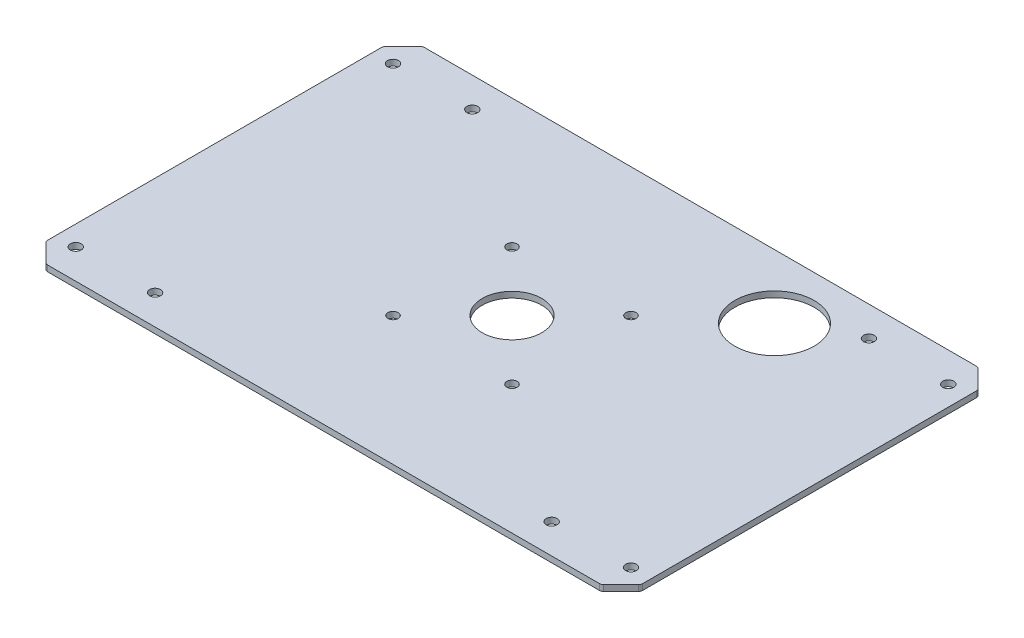
ISO-10303-21;
HEADER;
FILE_DESCRIPTION(('STEP AP214'),'2;1');
FILE_NAME('part.step','',(''),(''),'','','');
FILE_SCHEMA(('AUTOMOTIVE_DESIGN { 1 0 10303 214 1 1 1 1 }'));
ENDSEC;
DATA;
#1=APPLICATION_CONTEXT('core data for automotive mechanical design processes');
#2=APPLICATION_PROTOCOL_DEFINITION('international standard','automotive_design',2000,#1);
#3=PRODUCT_CONTEXT('',#1,'mechanical');
#4=PRODUCT('Part','Part','',(#3));
#5=PRODUCT_RELATED_PRODUCT_CATEGORY('part','',(#4));
#6=PRODUCT_DEFINITION_FORMATION('','',#4);
#7=PRODUCT_DEFINITION_CONTEXT('part definition',#1,'design');
#8=PRODUCT_DEFINITION('design','',#6,#7);
#9=PRODUCT_DEFINITION_SHAPE('','',#8);
#10=(LENGTH_UNIT() NAMED_UNIT(*) SI_UNIT(.MILLI.,.METRE.));
#11=(NAMED_UNIT(*) PLANE_ANGLE_UNIT() SI_UNIT($,.RADIAN.));
#12=(NAMED_UNIT(*) SI_UNIT($,.STERADIAN.) SOLID_ANGLE_UNIT());
#13=UNCERTAINTY_MEASURE_WITH_UNIT(LENGTH_MEASURE(1.E-05),#10,'distance_accuracy_value','');
#14=(GEOMETRIC_REPRESENTATION_CONTEXT(3) GLOBAL_UNCERTAINTY_ASSIGNED_CONTEXT((#13)) GLOBAL_UNIT_ASSIGNED_CONTEXT((#10,
#11,#12)) REPRESENTATION_CONTEXT('',''));
#15=CARTESIAN_POINT('',(0.,0.,0.));
#16=DIRECTION('',(0.,0.,1.));
#17=DIRECTION('',(1.,0.,0.));
#18=AXIS2_PLACEMENT_3D('',#15,#16,#17);
#19=CARTESIAN_POINT('',(140.,3.,-80.));
#20=DIRECTION('',(0.,-1.,0.));
#21=DIRECTION('',(0.,0.,-1.));
#22=AXIS2_PLACEMENT_3D('',#19,#20,#21);
#23=CYLINDRICAL_SURFACE('',#22,2.75000000000001);
#24=CARTESIAN_POINT('',(140.,3.,-80.));
#25=DIRECTION('',(0.,-1.,0.));
#26=DIRECTION('',(0.,0.,-1.));
#27=AXIS2_PLACEMENT_3D('',#24,#25,#26);
#28=CIRCLE('',#27,2.75000000000001);
#29=CARTESIAN_POINT('',(140.,3.,-82.75));
#30=VERTEX_POINT('',#29);
#31=EDGE_CURVE('E56',#30,#30,#28,.T.);
#32=ORIENTED_EDGE('',*,*,#31,.F.);
#33=EDGE_LOOP('',(#32));
#34=FACE_BOUND('',#33,.T.);
#35=CARTESIAN_POINT('',(140.,0.,-80.));
#36=DIRECTION('',(0.,-1.,0.));
#37=DIRECTION('',(0.,0.,-1.));
#38=AXIS2_PLACEMENT_3D('',#35,#36,#37);
#39=CIRCLE('',#38,2.75000000000001);
#40=CARTESIAN_POINT('',(140.,0.,-82.75));
#41=VERTEX_POINT('',#40);
#42=EDGE_CURVE('E11',#41,#41,#39,.T.);
#43=ORIENTED_EDGE('',*,*,#42,.T.);
#44=EDGE_LOOP('',(#43));
#45=FACE_BOUND('',#44,.T.);
#46=ADVANCED_FACE('F47',(#34,#45),#23,.F.);
#47=CARTESIAN_POINT('',(-100.,3.,-80.));
#48=DIRECTION('',(0.,-1.,0.));
#49=DIRECTION('',(0.,0.,-1.));
#50=AXIS2_PLACEMENT_3D('',#47,#48,#49);
#51=CYLINDRICAL_SURFACE('',#50,2.75000000000001);
#52=CARTESIAN_POINT('',(-100.,3.,-80.));
#53=DIRECTION('',(0.,-1.,0.));
#54=DIRECTION('',(0.,0.,-1.));
#55=AXIS2_PLACEMENT_3D('',#52,#53,#54);
#56=CIRCLE('',#55,2.75000000000001);
#57=CARTESIAN_POINT('',(-100.,3.,-82.75));
#58=VERTEX_POINT('',#57);
#59=EDGE_CURVE('E344',#58,#58,#56,.T.);
#60=ORIENTED_EDGE('',*,*,#59,.F.);
#61=EDGE_LOOP('',(#60));
#62=FACE_BOUND('',#61,.T.);
#63=CARTESIAN_POINT('',(-100.,0.,-80.));
#64=DIRECTION('',(0.,-1.,0.));
#65=DIRECTION('',(0.,0.,-1.));
#66=AXIS2_PLACEMENT_3D('',#63,#64,#65);
#67=CIRCLE('',#66,2.75000000000001);
#68=CARTESIAN_POINT('',(-100.,0.,-82.75));
#69=VERTEX_POINT('',#68);
#70=EDGE_CURVE('E348',#69,#69,#67,.T.);
#71=ORIENTED_EDGE('',*,*,#70,.T.);
#72=EDGE_LOOP('',(#71));
#73=FACE_BOUND('',#72,.T.);
#74=ADVANCED_FACE('F459',(#62,#73),#51,.F.);
#75=CARTESIAN_POINT('',(99.9999999999999,3.,-80.));
#76=DIRECTION('',(0.,-1.,0.));
#77=DIRECTION('',(0.,0.,-1.));
#78=AXIS2_PLACEMENT_3D('',#75,#76,#77);
#79=CYLINDRICAL_SURFACE('',#78,2.75000000000001);
#80=CARTESIAN_POINT('',(99.9999999999999,3.,-80.));
#81=DIRECTION('',(0.,-1.,0.));
#82=DIRECTION('',(0.,0.,-1.));
#83=AXIS2_PLACEMENT_3D('',#80,#81,#82);
#84=CIRCLE('',#83,2.75000000000001);
#85=CARTESIAN_POINT('',(99.9999999999999,3.,-82.75));
#86=VERTEX_POINT('',#85);
#87=EDGE_CURVE('E336',#86,#86,#84,.T.);
#88=ORIENTED_EDGE('',*,*,#87,.F.);
#89=EDGE_LOOP('',(#88));
#90=FACE_BOUND('',#89,.T.);
#91=CARTESIAN_POINT('',(99.9999999999999,0.,-80.));
#92=DIRECTION('',(0.,-1.,0.));
#93=DIRECTION('',(0.,0.,-1.));
#94=AXIS2_PLACEMENT_3D('',#91,#92,#93);
#95=CIRCLE('',#94,2.75000000000001);
#96=CARTESIAN_POINT('',(99.9999999999999,0.,-82.75));
#97=VERTEX_POINT('',#96);
#98=EDGE_CURVE('E340',#97,#97,#95,.T.);
#99=ORIENTED_EDGE('',*,*,#98,.T.);
#100=EDGE_LOOP('',(#99));
#101=FACE_BOUND('',#100,.T.);
#102=ADVANCED_FACE('F464',(#90,#101),#79,.F.);
#103=CARTESIAN_POINT('',(-140.,3.,-80.));
#104=DIRECTION('',(0.,-1.,0.));
#105=DIRECTION('',(0.,0.,-1.));
#106=AXIS2_PLACEMENT_3D('',#103,#104,#105);
#107=CYLINDRICAL_SURFACE('',#106,2.75000000000001);
#108=CARTESIAN_POINT('',(-140.,3.,-80.));
#109=DIRECTION('',(0.,-1.,0.));
#110=DIRECTION('',(0.,0.,-1.));
#111=AXIS2_PLACEMENT_3D('',#108,#109,#110);
#112=CIRCLE('',#111,2.75000000000001);
#113=CARTESIAN_POINT('',(-140.,3.,-82.75));
#114=VERTEX_POINT('',#113);
#115=EDGE_CURVE('E328',#114,#114,#112,.T.);
#116=ORIENTED_EDGE('',*,*,#115,.F.);
#117=EDGE_LOOP('',(#116));
#118=FACE_BOUND('',#117,.T.);
#119=CARTESIAN_POINT('',(-140.,0.,-80.));
#120=DIRECTION('',(0.,-1.,0.));
#121=DIRECTION('',(0.,0.,-1.));
#122=AXIS2_PLACEMENT_3D('',#119,#120,#121);
#123=CIRCLE('',#122,2.75000000000001);
#124=CARTESIAN_POINT('',(-140.,0.,-82.75));
#125=VERTEX_POINT('',#124);
#126=EDGE_CURVE('E332',#125,#125,#123,.T.);
#127=ORIENTED_EDGE('',*,*,#126,.T.);
#128=EDGE_LOOP('',(#127));
#129=FACE_BOUND('',#128,.T.);
#130=ADVANCED_FACE('F495',(#118,#129),#107,.F.);
#131=CARTESIAN_POINT('',(150.,3.,95.));
#132=DIRECTION('',(-1.,0.,0.));
#133=DIRECTION('',(0.,0.,1.));
#134=AXIS2_PLACEMENT_3D('',#131,#132,#133);
#135=PLANE('',#134);
#136=DIRECTION('',(0.,0.,-1.));
#137=VECTOR('',#136,1.);
#138=CARTESIAN_POINT('',(150.,0.,95.));
#139=LINE('',#138,#137);
#140=CARTESIAN_POINT('',(150.,0.,84.1715728752538));
#141=VERTEX_POINT('',#140);
#142=CARTESIAN_POINT('',(150.,0.,-84.1715728752538));
#143=VERTEX_POINT('',#142);
#144=EDGE_CURVE('E206',#141,#143,#139,.T.);
#145=ORIENTED_EDGE('',*,*,#144,.T.);
#146=DIRECTION('',(0.,-1.,0.));
#147=VECTOR('',#146,1.);
#148=CARTESIAN_POINT('',(150.,3.,-84.1715728752538));
#149=LINE('',#148,#147);
#150=CARTESIAN_POINT('',(150.,3.,-84.1715728752538));
#151=VERTEX_POINT('',#150);
#152=EDGE_CURVE('E304',#143,#151,#149,.F.);
#153=ORIENTED_EDGE('',*,*,#152,.T.);
#154=DIRECTION('',(0.,0.,-1.));
#155=VECTOR('',#154,1.);
#156=CARTESIAN_POINT('',(150.,3.,95.));
#157=LINE('',#156,#155);
#158=CARTESIAN_POINT('',(150.,3.,84.1715728752538));
#159=VERTEX_POINT('',#158);
#160=EDGE_CURVE('E203',#159,#151,#157,.T.);
#161=ORIENTED_EDGE('',*,*,#160,.F.);
#162=DIRECTION('',(0.,1.,0.));
#163=VECTOR('',#162,1.);
#164=CARTESIAN_POINT('',(150.,0.,84.1715728752538));
#165=LINE('',#164,#163);
#166=EDGE_CURVE('E300',#159,#141,#165,.F.);
#167=ORIENTED_EDGE('',*,*,#166,.T.);
#168=EDGE_LOOP('',(#145,#153,#161,#167));
#169=FACE_BOUND('',#168,.T.);
#170=ADVANCED_FACE('F423',(#169),#135,.F.);
#171=CARTESIAN_POINT('',(-150.,3.,-95.));
#172=DIRECTION('',(0.,0.,1.));
#173=DIRECTION('',(1.,0.,0.));
#174=AXIS2_PLACEMENT_3D('',#171,#172,#173);
#175=PLANE('',#174);
#176=DIRECTION('',(-1.,0.,0.));
#177=VECTOR('',#176,1.);
#178=CARTESIAN_POINT('',(-150.,0.,-95.));
#179=LINE('',#178,#177);
#180=CARTESIAN_POINT('',(139.171572875254,0.,-95.));
#181=VERTEX_POINT('',#180);
#182=CARTESIAN_POINT('',(-139.171572875254,0.,-95.));
#183=VERTEX_POINT('',#182);
#184=EDGE_CURVE('E198',#181,#183,#179,.T.);
#185=ORIENTED_EDGE('',*,*,#184,.T.);
#186=DIRECTION('',(0.,-1.,0.));
#187=VECTOR('',#186,1.);
#188=CARTESIAN_POINT('',(-139.171572875254,3.,-95.));
#189=LINE('',#188,#187);
#190=CARTESIAN_POINT('',(-139.171572875254,3.,-95.));
#191=VERTEX_POINT('',#190);
#192=EDGE_CURVE('E291',#183,#191,#189,.F.);
#193=ORIENTED_EDGE('',*,*,#192,.T.);
#194=DIRECTION('',(-1.,0.,0.));
#195=VECTOR('',#194,1.);
#196=CARTESIAN_POINT('',(-150.,3.,-95.));
#197=LINE('',#196,#195);
#198=CARTESIAN_POINT('',(139.171572875254,3.,-95.));
#199=VERTEX_POINT('',#198);
#200=EDGE_CURVE('E411',#199,#191,#197,.T.);
#201=ORIENTED_EDGE('',*,*,#200,.F.);
#202=DIRECTION('',(0.,1.,0.));
#203=VECTOR('',#202,1.);
#204=CARTESIAN_POINT('',(139.171572875254,0.,-95.));
#205=LINE('',#204,#203);
#206=EDGE_CURVE('E287',#199,#181,#205,.F.);
#207=ORIENTED_EDGE('',*,*,#206,.T.);
#208=EDGE_LOOP('',(#185,#193,#201,#207));
#209=FACE_BOUND('',#208,.T.);
#210=ADVANCED_FACE('F442',(#209),#175,.F.);
#211=CARTESIAN_POINT('',(-150.,3.,95.));
#212=DIRECTION('',(1.,0.,0.));
#213=DIRECTION('',(0.,0.,-1.));
#214=AXIS2_PLACEMENT_3D('',#211,#212,#213);
#215=PLANE('',#214);
#216=DIRECTION('',(0.,0.,1.));
#217=VECTOR('',#216,1.);
#218=CARTESIAN_POINT('',(-150.,3.,95.));
#219=LINE('',#218,#217);
#220=CARTESIAN_POINT('',(-150.,3.,-84.1715728752537));
#221=VERTEX_POINT('',#220);
#222=CARTESIAN_POINT('',(-150.,3.,84.1715728752538));
#223=VERTEX_POINT('',#222);
#224=EDGE_CURVE('E187',#221,#223,#219,.T.);
#225=ORIENTED_EDGE('',*,*,#224,.F.);
#226=DIRECTION('',(0.,1.,0.));
#227=VECTOR('',#226,1.);
#228=CARTESIAN_POINT('',(-150.,0.,-84.1715728752537));
#229=LINE('',#228,#227);
#230=CARTESIAN_POINT('',(-150.,0.,-84.1715728752537));
#231=VERTEX_POINT('',#230);
#232=EDGE_CURVE('E169',#221,#231,#229,.F.);
#233=ORIENTED_EDGE('',*,*,#232,.T.);
#234=DIRECTION('',(0.,0.,1.));
#235=VECTOR('',#234,1.);
#236=CARTESIAN_POINT('',(-150.,0.,95.));
#237=LINE('',#236,#235);
#238=CARTESIAN_POINT('',(-150.,0.,84.1715728752538));
#239=VERTEX_POINT('',#238);
#240=EDGE_CURVE('E184',#231,#239,#237,.T.);
#241=ORIENTED_EDGE('',*,*,#240,.T.);
#242=DIRECTION('',(0.,-1.,0.));
#243=VECTOR('',#242,1.);
#244=CARTESIAN_POINT('',(-150.,3.,84.1715728752538));
#245=LINE('',#244,#243);
#246=EDGE_CURVE('E190',#239,#223,#245,.F.);
#247=ORIENTED_EDGE('',*,*,#246,.T.);
#248=EDGE_LOOP('',(#225,#233,#241,#247));
#249=FACE_BOUND('',#248,.T.);
#250=ADVANCED_FACE('F182',(#249),#215,.F.);
#251=CARTESIAN_POINT('',(-150.,3.,95.));
#252=DIRECTION('',(0.,0.,-1.));
#253=DIRECTION('',(-1.,0.,0.));
#254=AXIS2_PLACEMENT_3D('',#251,#252,#253);
#255=PLANE('',#254);
#256=DIRECTION('',(1.,0.,0.));
#257=VECTOR('',#256,1.);
#258=CARTESIAN_POINT('',(-150.,0.,95.));
#259=LINE('',#258,#257);
#260=CARTESIAN_POINT('',(-139.171572875254,0.,95.));
#261=VERTEX_POINT('',#260);
#262=CARTESIAN_POINT('',(139.171572875254,0.,95.));
#263=VERTEX_POINT('',#262);
#264=EDGE_CURVE('E197',#261,#263,#259,.T.);
#265=ORIENTED_EDGE('',*,*,#264,.T.);
#266=DIRECTION('',(0.,-1.,0.));
#267=VECTOR('',#266,1.);
#268=CARTESIAN_POINT('',(139.171572875254,3.,95.));
#269=LINE('',#268,#267);
#270=CARTESIAN_POINT('',(139.171572875254,3.,95.));
#271=VERTEX_POINT('',#270);
#272=EDGE_CURVE('E318',#263,#271,#269,.F.);
#273=ORIENTED_EDGE('',*,*,#272,.T.);
#274=DIRECTION('',(1.,0.,0.));
#275=VECTOR('',#274,1.);
#276=CARTESIAN_POINT('',(-150.,3.,95.));
#277=LINE('',#276,#275);
#278=CARTESIAN_POINT('',(-139.171572875254,3.,95.));
#279=VERTEX_POINT('',#278);
#280=EDGE_CURVE('E214',#279,#271,#277,.T.);
#281=ORIENTED_EDGE('',*,*,#280,.F.);
#282=DIRECTION('',(0.,1.,0.));
#283=VECTOR('',#282,1.);
#284=CARTESIAN_POINT('',(-139.171572875254,0.,95.));
#285=LINE('',#284,#283);
#286=EDGE_CURVE('E314',#279,#261,#285,.F.);
#287=ORIENTED_EDGE('',*,*,#286,.T.);
#288=EDGE_LOOP('',(#265,#273,#281,#287));
#289=FACE_BOUND('',#288,.T.);
#290=ADVANCED_FACE('F480',(#289),#255,.F.);
#291=CARTESIAN_POINT('',(0.,3.,0.));
#292=DIRECTION('',(0.,-1.,0.));
#293=DIRECTION('',(0.,0.,-1.));
#294=AXIS2_PLACEMENT_3D('',#291,#292,#293);
#295=PLANE('',#294);
#296=CARTESIAN_POINT('',(-30.,3.,30.));
#297=DIRECTION('',(0.,1.,0.));
#298=DIRECTION('',(0.,0.,1.));
#299=AXIS2_PLACEMENT_3D('',#296,#297,#298);
#300=CIRCLE('',#299,2.6);
#301=CARTESIAN_POINT('',(-30.,3.,32.6));
#302=VERTEX_POINT('',#301);
#303=EDGE_CURVE('E884',#302,#302,#300,.T.);
#304=ORIENTED_EDGE('',*,*,#303,.F.);
#305=EDGE_LOOP('',(#304));
#306=FACE_BOUND('',#305,.T.);
#307=CARTESIAN_POINT('',(30.,3.,30.));
#308=DIRECTION('',(0.,1.,0.));
#309=DIRECTION('',(0.,0.,1.));
#310=AXIS2_PLACEMENT_3D('',#307,#308,#309);
#311=CIRCLE('',#310,2.6);
#312=CARTESIAN_POINT('',(30.,3.,32.6));
#313=VERTEX_POINT('',#312);
#314=EDGE_CURVE('E891',#313,#313,#311,.T.);
#315=ORIENTED_EDGE('',*,*,#314,.F.);
#316=EDGE_LOOP('',(#315));
#317=FACE_BOUND('',#316,.T.);
#318=CARTESIAN_POINT('',(30.,3.,-30.));
#319=DIRECTION('',(0.,1.,0.));
#320=DIRECTION('',(0.,0.,1.));
#321=AXIS2_PLACEMENT_3D('',#318,#319,#320);
#322=CIRCLE('',#321,2.6);
#323=CARTESIAN_POINT('',(30.,3.,-27.4));
#324=VERTEX_POINT('',#323);
#325=EDGE_CURVE('E901',#324,#324,#322,.T.);
#326=ORIENTED_EDGE('',*,*,#325,.F.);
#327=EDGE_LOOP('',(#326));
#328=FACE_BOUND('',#327,.T.);
#329=CARTESIAN_POINT('',(-30.,3.,-30.));
#330=DIRECTION('',(0.,1.,0.));
#331=DIRECTION('',(0.,0.,1.));
#332=AXIS2_PLACEMENT_3D('',#329,#330,#331);
#333=CIRCLE('',#332,2.6);
#334=CARTESIAN_POINT('',(-30.,3.,-27.4));
#335=VERTEX_POINT('',#334);
#336=EDGE_CURVE('E374',#335,#335,#333,.T.);
#337=ORIENTED_EDGE('',*,*,#336,.F.);
#338=EDGE_LOOP('',(#337));
#339=FACE_BOUND('',#338,.T.);
#340=CARTESIAN_POINT('',(69.5499999999999,3.,-62.8));
#341=DIRECTION('',(0.,1.,0.));
#342=DIRECTION('',(0.,0.,1.));
#343=AXIS2_PLACEMENT_3D('',#340,#341,#342);
#344=CIRCLE('',#343,20.);
#345=CARTESIAN_POINT('',(69.5499999999999,3.,-42.8));
#346=VERTEX_POINT('',#345);
#347=EDGE_CURVE('E357',#346,#346,#344,.T.);
#348=ORIENTED_EDGE('',*,*,#347,.F.);
#349=EDGE_LOOP('',(#348));
#350=FACE_BOUND('',#349,.T.);
#351=CARTESIAN_POINT('',(0.,3.,0.));
#352=DIRECTION('',(0.,1.,0.));
#353=DIRECTION('',(0.,0.,1.));
#354=AXIS2_PLACEMENT_3D('',#351,#352,#353);
#355=CIRCLE('',#354,15.);
#356=CARTESIAN_POINT('',(0.,3.,15.));
#357=VERTEX_POINT('',#356);
#358=EDGE_CURVE('E365',#357,#357,#355,.T.);
#359=ORIENTED_EDGE('',*,*,#358,.F.);
#360=EDGE_LOOP('',(#359));
#361=FACE_BOUND('',#360,.T.);
#362=CARTESIAN_POINT('',(140.,3.,80.));
#363=DIRECTION('',(0.,-1.,0.));
#364=DIRECTION('',(0.,0.,-1.));
#365=AXIS2_PLACEMENT_3D('',#362,#363,#364);
#366=CIRCLE('',#365,2.75000000000001);
#367=CARTESIAN_POINT('',(140.,3.,77.25));
#368=VERTEX_POINT('',#367);
#369=EDGE_CURVE('E363',#368,#368,#366,.T.);
#370=ORIENTED_EDGE('',*,*,#369,.T.);
#371=EDGE_LOOP('',(#370));
#372=FACE_BOUND('',#371,.T.);
#373=CARTESIAN_POINT('',(99.9999999999999,3.,80.));
#374=DIRECTION('',(0.,-1.,0.));
#375=DIRECTION('',(0.,0.,-1.));
#376=AXIS2_PLACEMENT_3D('',#373,#374,#375);
#377=CIRCLE('',#376,2.75000000000001);
#378=CARTESIAN_POINT('',(99.9999999999999,3.,77.25));
#379=VERTEX_POINT('',#378);
#380=EDGE_CURVE('E384',#379,#379,#377,.T.);
#381=ORIENTED_EDGE('',*,*,#380,.T.);
#382=EDGE_LOOP('',(#381));
#383=FACE_BOUND('',#382,.T.);
#384=CARTESIAN_POINT('',(-140.,3.,80.));
#385=DIRECTION('',(0.,-1.,0.));
#386=DIRECTION('',(0.,0.,-1.));
#387=AXIS2_PLACEMENT_3D('',#384,#385,#386);
#388=CIRCLE('',#387,2.75000000000001);
#389=CARTESIAN_POINT('',(-140.,3.,77.25));
#390=VERTEX_POINT('',#389);
#391=EDGE_CURVE('E393',#390,#390,#388,.T.);
#392=ORIENTED_EDGE('',*,*,#391,.T.);
#393=EDGE_LOOP('',(#392));
#394=FACE_BOUND('',#393,.T.);
#395=CARTESIAN_POINT('',(-100.,3.,80.));
#396=DIRECTION('',(0.,-1.,0.));
#397=DIRECTION('',(0.,0.,-1.));
#398=AXIS2_PLACEMENT_3D('',#395,#396,#397);
#399=CIRCLE('',#398,2.75000000000001);
#400=CARTESIAN_POINT('',(-100.,3.,77.25));
#401=VERTEX_POINT('',#400);
#402=EDGE_CURVE('E392',#401,#401,#399,.T.);
#403=ORIENTED_EDGE('',*,*,#402,.T.);
#404=EDGE_LOOP('',(#403));
#405=FACE_BOUND('',#404,.T.);
#406=DIRECTION('',(0.707106781186548,0.,-0.707106781186548));
#407=VECTOR('',#406,1.);
#408=CARTESIAN_POINT('',(-150.,3.,-84.9999999999999));
#409=LINE('',#408,#407);
#410=CARTESIAN_POINT('',(-140.585786437627,3.,-94.4142135623731));
#411=VERTEX_POINT('',#410);
#412=CARTESIAN_POINT('',(-149.414213562373,3.,-85.5857864376268));
#413=VERTEX_POINT('',#412);
#414=EDGE_CURVE('E225',#411,#413,#409,.F.);
#415=ORIENTED_EDGE('',*,*,#414,.T.);
#416=CARTESIAN_POINT('',(-148.,3.,-84.1715728752537));
#417=DIRECTION('',(0.,-1.,0.));
#418=DIRECTION('',(0.,0.,-1.));
#419=AXIS2_PLACEMENT_3D('',#416,#417,#418);
#420=CIRCLE('',#419,2.);
#421=EDGE_CURVE('E284',#413,#221,#420,.F.);
#422=ORIENTED_EDGE('',*,*,#421,.T.);
#423=ORIENTED_EDGE('',*,*,#224,.T.);
#424=CARTESIAN_POINT('',(-148.,3.,84.1715728752538));
#425=DIRECTION('',(0.,-1.,0.));
#426=DIRECTION('',(0.,0.,-1.));
#427=AXIS2_PLACEMENT_3D('',#424,#425,#426);
#428=CIRCLE('',#427,2.);
#429=CARTESIAN_POINT('',(-149.414213562373,3.,85.5857864376269));
#430=VERTEX_POINT('',#429);
#431=EDGE_CURVE('E265',#223,#430,#428,.F.);
#432=ORIENTED_EDGE('',*,*,#431,.T.);
#433=DIRECTION('',(-0.707106781186546,0.,-0.707106781186549));
#434=VECTOR('',#433,1.);
#435=CARTESIAN_POINT('',(-140.,3.,95.));
#436=LINE('',#435,#434);
#437=CARTESIAN_POINT('',(-140.585786437627,3.,94.4142135623731));
#438=VERTEX_POINT('',#437);
#439=EDGE_CURVE('E236',#430,#438,#436,.F.);
#440=ORIENTED_EDGE('',*,*,#439,.T.);
#441=CARTESIAN_POINT('',(-139.171572875254,3.,93.));
#442=DIRECTION('',(0.,-1.,0.));
#443=DIRECTION('',(0.,0.,-1.));
#444=AXIS2_PLACEMENT_3D('',#441,#442,#443);
#445=CIRCLE('',#444,2.);
#446=EDGE_CURVE('E268',#438,#279,#445,.F.);
#447=ORIENTED_EDGE('',*,*,#446,.T.);
#448=ORIENTED_EDGE('',*,*,#280,.T.);
#449=CARTESIAN_POINT('',(139.171572875254,3.,93.));
#450=DIRECTION('',(0.,-1.,0.));
#451=DIRECTION('',(0.,0.,-1.));
#452=AXIS2_PLACEMENT_3D('',#449,#450,#451);
#453=CIRCLE('',#452,2.);
#454=CARTESIAN_POINT('',(140.585786437627,3.,94.4142135623731));
#455=VERTEX_POINT('',#454);
#456=EDGE_CURVE('E271',#271,#455,#453,.F.);
#457=ORIENTED_EDGE('',*,*,#456,.T.);
#458=DIRECTION('',(-0.707106781186548,0.,0.707106781186548));
#459=VECTOR('',#458,1.);
#460=CARTESIAN_POINT('',(150.,3.,85.));
#461=LINE('',#460,#459);
#462=CARTESIAN_POINT('',(149.414213562373,3.,85.5857864376269));
#463=VERTEX_POINT('',#462);
#464=EDGE_CURVE('E232',#455,#463,#461,.F.);
#465=ORIENTED_EDGE('',*,*,#464,.T.);
#466=CARTESIAN_POINT('',(148.,3.,84.1715728752538));
#467=DIRECTION('',(0.,-1.,0.));
#468=DIRECTION('',(0.,0.,-1.));
#469=AXIS2_PLACEMENT_3D('',#466,#467,#468);
#470=CIRCLE('',#469,2.);
#471=EDGE_CURVE('E274',#463,#159,#470,.F.);
#472=ORIENTED_EDGE('',*,*,#471,.T.);
#473=ORIENTED_EDGE('',*,*,#160,.T.);
#474=CARTESIAN_POINT('',(148.,3.,-84.1715728752538));
#475=DIRECTION('',(0.,-1.,0.));
#476=DIRECTION('',(0.,0.,-1.));
#477=AXIS2_PLACEMENT_3D('',#474,#475,#476);
#478=CIRCLE('',#477,2.);
#479=CARTESIAN_POINT('',(149.414213562373,3.,-85.5857864376269));
#480=VERTEX_POINT('',#479);
#481=EDGE_CURVE('E277',#151,#480,#478,.F.);
#482=ORIENTED_EDGE('',*,*,#481,.T.);
#483=DIRECTION('',(0.707106781186546,0.,0.707106781186549));
#484=VECTOR('',#483,1.);
#485=CARTESIAN_POINT('',(140.,3.,-95.));
#486=LINE('',#485,#484);
#487=CARTESIAN_POINT('',(140.585786437627,3.,-94.4142135623731));
#488=VERTEX_POINT('',#487);
#489=EDGE_CURVE('E229',#480,#488,#486,.F.);
#490=ORIENTED_EDGE('',*,*,#489,.T.);
#491=CARTESIAN_POINT('',(139.171572875254,3.,-93.));
#492=DIRECTION('',(0.,-1.,0.));
#493=DIRECTION('',(0.,0.,-1.));
#494=AXIS2_PLACEMENT_3D('',#491,#492,#493);
#495=CIRCLE('',#494,2.);
#496=EDGE_CURVE('E72',#488,#199,#495,.F.);
#497=ORIENTED_EDGE('',*,*,#496,.T.);
#498=ORIENTED_EDGE('',*,*,#200,.T.);
#499=CARTESIAN_POINT('',(-139.171572875254,3.,-93.));
#500=DIRECTION('',(0.,-1.,0.));
#501=DIRECTION('',(0.,0.,-1.));
#502=AXIS2_PLACEMENT_3D('',#499,#500,#501);
#503=CIRCLE('',#502,2.);
#504=EDGE_CURVE('E64',#191,#411,#503,.F.);
#505=ORIENTED_EDGE('',*,*,#504,.T.);
#506=EDGE_LOOP('',(#415,#422,#423,#432,#440,#447,#448,#457,#465,#472,#473,#482,#490,#497,#498,#505));
#507=FACE_BOUND('',#506,.T.);
#508=ORIENTED_EDGE('',*,*,#115,.T.);
#509=EDGE_LOOP('',(#508));
#510=FACE_BOUND('',#509,.T.);
#511=ORIENTED_EDGE('',*,*,#87,.T.);
#512=EDGE_LOOP('',(#511));
#513=FACE_BOUND('',#512,.T.);
#514=ORIENTED_EDGE('',*,*,#59,.T.);
#515=EDGE_LOOP('',(#514));
#516=FACE_BOUND('',#515,.T.);
#517=ORIENTED_EDGE('',*,*,#31,.T.);
#518=EDGE_LOOP('',(#517));
#519=FACE_BOUND('',#518,.T.);
#520=ADVANCED_FACE('F431',(#306,#317,#328,#339,#350,#361,#372,#383,#394,#405,#507,#510,#513,
#516,#519),#295,.F.);
#521=CARTESIAN_POINT('',(0.,0.,0.));
#522=DIRECTION('',(0.,-1.,0.));
#523=DIRECTION('',(0.,0.,-1.));
#524=AXIS2_PLACEMENT_3D('',#521,#522,#523);
#525=PLANE('',#524);
#526=CARTESIAN_POINT('',(-30.,0.,30.));
#527=DIRECTION('',(0.,1.,0.));
#528=DIRECTION('',(0.,0.,1.));
#529=AXIS2_PLACEMENT_3D('',#526,#527,#528);
#530=CIRCLE('',#529,2.6);
#531=CARTESIAN_POINT('',(-30.,0.,32.6));
#532=VERTEX_POINT('',#531);
#533=EDGE_CURVE('E881',#532,#532,#530,.T.);
#534=ORIENTED_EDGE('',*,*,#533,.T.);
#535=EDGE_LOOP('',(#534));
#536=FACE_BOUND('',#535,.T.);
#537=CARTESIAN_POINT('',(30.,0.,30.));
#538=DIRECTION('',(0.,1.,0.));
#539=DIRECTION('',(0.,0.,1.));
#540=AXIS2_PLACEMENT_3D('',#537,#538,#539);
#541=CIRCLE('',#540,2.6);
#542=CARTESIAN_POINT('',(30.,0.,32.6));
#543=VERTEX_POINT('',#542);
#544=EDGE_CURVE('E886',#543,#543,#541,.T.);
#545=ORIENTED_EDGE('',*,*,#544,.T.);
#546=EDGE_LOOP('',(#545));
#547=FACE_BOUND('',#546,.T.);
#548=CARTESIAN_POINT('',(30.,0.,-30.));
#549=DIRECTION('',(0.,1.,0.));
#550=DIRECTION('',(0.,0.,1.));
#551=AXIS2_PLACEMENT_3D('',#548,#549,#550);
#552=CIRCLE('',#551,2.6);
#553=CARTESIAN_POINT('',(30.,0.,-27.4));
#554=VERTEX_POINT('',#553);
#555=EDGE_CURVE('E906',#554,#554,#552,.T.);
#556=ORIENTED_EDGE('',*,*,#555,.T.);
#557=EDGE_LOOP('',(#556));
#558=FACE_BOUND('',#557,.T.);
#559=CARTESIAN_POINT('',(-30.,0.,-30.));
#560=DIRECTION('',(0.,1.,0.));
#561=DIRECTION('',(0.,0.,1.));
#562=AXIS2_PLACEMENT_3D('',#559,#560,#561);
#563=CIRCLE('',#562,2.6);
#564=CARTESIAN_POINT('',(-30.,0.,-27.4));
#565=VERTEX_POINT('',#564);
#566=EDGE_CURVE('E371',#565,#565,#563,.T.);
#567=ORIENTED_EDGE('',*,*,#566,.T.);
#568=EDGE_LOOP('',(#567));
#569=FACE_BOUND('',#568,.T.);
#570=CARTESIAN_POINT('',(69.5499999999999,0.,-62.8));
#571=DIRECTION('',(0.,-1.,0.));
#572=DIRECTION('',(0.,0.,-1.));
#573=AXIS2_PLACEMENT_3D('',#570,#571,#572);
#574=CIRCLE('',#573,20.);
#575=CARTESIAN_POINT('',(69.5499999999999,0.,-82.8));
#576=VERTEX_POINT('',#575);
#577=EDGE_CURVE('E50',#576,#576,#574,.T.);
#578=ORIENTED_EDGE('',*,*,#577,.F.);
#579=EDGE_LOOP('',(#578));
#580=FACE_BOUND('',#579,.T.);
#581=CARTESIAN_POINT('',(0.,0.,0.));
#582=DIRECTION('',(0.,-1.,0.));
#583=DIRECTION('',(0.,0.,-1.));
#584=AXIS2_PLACEMENT_3D('',#581,#582,#583);
#585=CIRCLE('',#584,15.);
#586=CARTESIAN_POINT('',(0.,0.,-15.));
#587=VERTEX_POINT('',#586);
#588=EDGE_CURVE('E354',#587,#587,#585,.T.);
#589=ORIENTED_EDGE('',*,*,#588,.F.);
#590=EDGE_LOOP('',(#589));
#591=FACE_BOUND('',#590,.T.);
#592=CARTESIAN_POINT('',(140.,0.,80.));
#593=DIRECTION('',(0.,-1.,0.));
#594=DIRECTION('',(0.,0.,-1.));
#595=AXIS2_PLACEMENT_3D('',#592,#593,#594);
#596=CIRCLE('',#595,2.75000000000001);
#597=CARTESIAN_POINT('',(140.,0.,77.25));
#598=VERTEX_POINT('',#597);
#599=EDGE_CURVE('E380',#598,#598,#596,.T.);
#600=ORIENTED_EDGE('',*,*,#599,.F.);
#601=EDGE_LOOP('',(#600));
#602=FACE_BOUND('',#601,.T.);
#603=CARTESIAN_POINT('',(99.9999999999999,0.,80.));
#604=DIRECTION('',(0.,-1.,0.));
#605=DIRECTION('',(0.,0.,-1.));
#606=AXIS2_PLACEMENT_3D('',#603,#604,#605);
#607=CIRCLE('',#606,2.75000000000001);
#608=CARTESIAN_POINT('',(99.9999999999999,0.,77.25));
#609=VERTEX_POINT('',#608);
#610=EDGE_CURVE('E388',#609,#609,#607,.T.);
#611=ORIENTED_EDGE('',*,*,#610,.F.);
#612=EDGE_LOOP('',(#611));
#613=FACE_BOUND('',#612,.T.);
#614=CARTESIAN_POINT('',(-140.,0.,80.));
#615=DIRECTION('',(0.,-1.,0.));
#616=DIRECTION('',(0.,0.,-1.));
#617=AXIS2_PLACEMENT_3D('',#614,#615,#616);
#618=CIRCLE('',#617,2.75000000000001);
#619=CARTESIAN_POINT('',(-140.,0.,77.25));
#620=VERTEX_POINT('',#619);
#621=EDGE_CURVE('E397',#620,#620,#618,.T.);
#622=ORIENTED_EDGE('',*,*,#621,.F.);
#623=EDGE_LOOP('',(#622));
#624=FACE_BOUND('',#623,.T.);
#625=CARTESIAN_POINT('',(-100.,0.,80.));
#626=DIRECTION('',(0.,-1.,0.));
#627=DIRECTION('',(0.,0.,-1.));
#628=AXIS2_PLACEMENT_3D('',#625,#626,#627);
#629=CIRCLE('',#628,2.75000000000001);
#630=CARTESIAN_POINT('',(-100.,0.,77.25));
#631=VERTEX_POINT('',#630);
#632=EDGE_CURVE('E401',#631,#631,#629,.T.);
#633=ORIENTED_EDGE('',*,*,#632,.F.);
#634=EDGE_LOOP('',(#633));
#635=FACE_BOUND('',#634,.T.);
#636=ORIENTED_EDGE('',*,*,#240,.F.);
#637=CARTESIAN_POINT('',(-148.,0.,-84.1715728752537));
#638=DIRECTION('',(0.,-1.,0.));
#639=DIRECTION('',(0.,0.,-1.));
#640=AXIS2_PLACEMENT_3D('',#637,#638,#639);
#641=CIRCLE('',#640,2.);
#642=CARTESIAN_POINT('',(-149.414213562373,0.,-85.5857864376268));
#643=VERTEX_POINT('',#642);
#644=EDGE_CURVE('E165',#231,#643,#641,.T.);
#645=ORIENTED_EDGE('',*,*,#644,.T.);
#646=DIRECTION('',(-0.707106781186548,0.,0.707106781186548));
#647=VECTOR('',#646,1.);
#648=CARTESIAN_POINT('',(-117.5,0.,-117.5));
#649=LINE('',#648,#647);
#650=CARTESIAN_POINT('',(-140.585786437627,0.,-94.4142135623731));
#651=VERTEX_POINT('',#650);
#652=EDGE_CURVE('E210',#643,#651,#649,.F.);
#653=ORIENTED_EDGE('',*,*,#652,.T.);
#654=CARTESIAN_POINT('',(-139.171572875254,0.,-93.));
#655=DIRECTION('',(0.,-1.,0.));
#656=DIRECTION('',(0.,0.,-1.));
#657=AXIS2_PLACEMENT_3D('',#654,#655,#656);
#658=CIRCLE('',#657,2.);
#659=EDGE_CURVE('E177',#651,#183,#658,.T.);
#660=ORIENTED_EDGE('',*,*,#659,.T.);
#661=ORIENTED_EDGE('',*,*,#184,.F.);
#662=CARTESIAN_POINT('',(139.171572875254,0.,-93.));
#663=DIRECTION('',(0.,-1.,0.));
#664=DIRECTION('',(0.,0.,-1.));
#665=AXIS2_PLACEMENT_3D('',#662,#663,#664);
#666=CIRCLE('',#665,2.);
#667=CARTESIAN_POINT('',(140.585786437627,0.,-94.4142135623731));
#668=VERTEX_POINT('',#667);
#669=EDGE_CURVE('E256',#181,#668,#666,.T.);
#670=ORIENTED_EDGE('',*,*,#669,.T.);
#671=DIRECTION('',(-0.707106781186546,0.,-0.707106781186549));
#672=VECTOR('',#671,1.);
#673=CARTESIAN_POINT('',(117.5,0.,-117.5));
#674=LINE('',#673,#672);
#675=CARTESIAN_POINT('',(149.414213562373,0.,-85.5857864376269));
#676=VERTEX_POINT('',#675);
#677=EDGE_CURVE('E213',#668,#676,#674,.F.);
#678=ORIENTED_EDGE('',*,*,#677,.T.);
#679=CARTESIAN_POINT('',(148.,0.,-84.1715728752538));
#680=DIRECTION('',(0.,-1.,0.));
#681=DIRECTION('',(0.,0.,-1.));
#682=AXIS2_PLACEMENT_3D('',#679,#680,#681);
#683=CIRCLE('',#682,2.);
#684=EDGE_CURVE('E253',#676,#143,#683,.T.);
#685=ORIENTED_EDGE('',*,*,#684,.T.);
#686=ORIENTED_EDGE('',*,*,#144,.F.);
#687=CARTESIAN_POINT('',(148.,0.,84.1715728752538));
#688=DIRECTION('',(0.,-1.,0.));
#689=DIRECTION('',(0.,0.,-1.));
#690=AXIS2_PLACEMENT_3D('',#687,#688,#689);
#691=CIRCLE('',#690,2.);
#692=CARTESIAN_POINT('',(149.414213562373,0.,85.5857864376269));
#693=VERTEX_POINT('',#692);
#694=EDGE_CURVE('E250',#141,#693,#691,.T.);
#695=ORIENTED_EDGE('',*,*,#694,.T.);
#696=DIRECTION('',(0.707106781186548,0.,-0.707106781186548));
#697=VECTOR('',#696,1.);
#698=CARTESIAN_POINT('',(117.5,0.,117.5));
#699=LINE('',#698,#697);
#700=CARTESIAN_POINT('',(140.585786437627,0.,94.4142135623731));
#701=VERTEX_POINT('',#700);
#702=EDGE_CURVE('E218',#693,#701,#699,.F.);
#703=ORIENTED_EDGE('',*,*,#702,.T.);
#704=CARTESIAN_POINT('',(139.171572875254,0.,93.));
#705=DIRECTION('',(0.,-1.,0.));
#706=DIRECTION('',(0.,0.,-1.));
#707=AXIS2_PLACEMENT_3D('',#704,#705,#706);
#708=CIRCLE('',#707,2.);
#709=EDGE_CURVE('E247',#701,#263,#708,.T.);
#710=ORIENTED_EDGE('',*,*,#709,.T.);
#711=ORIENTED_EDGE('',*,*,#264,.F.);
#712=CARTESIAN_POINT('',(-139.171572875254,0.,93.));
#713=DIRECTION('',(0.,-1.,0.));
#714=DIRECTION('',(0.,0.,-1.));
#715=AXIS2_PLACEMENT_3D('',#712,#713,#714);
#716=CIRCLE('',#715,2.);
#717=CARTESIAN_POINT('',(-140.585786437627,0.,94.4142135623731));
#718=VERTEX_POINT('',#717);
#719=EDGE_CURVE('E244',#261,#718,#716,.T.);
#720=ORIENTED_EDGE('',*,*,#719,.T.);
#721=DIRECTION('',(0.707106781186546,0.,0.707106781186549));
#722=VECTOR('',#721,1.);
#723=CARTESIAN_POINT('',(-117.5,0.,117.5));
#724=LINE('',#723,#722);
#725=CARTESIAN_POINT('',(-149.414213562373,0.,85.5857864376269));
#726=VERTEX_POINT('',#725);
#727=EDGE_CURVE('E222',#718,#726,#724,.F.);
#728=ORIENTED_EDGE('',*,*,#727,.T.);
#729=CARTESIAN_POINT('',(-148.,0.,84.1715728752538));
#730=DIRECTION('',(0.,-1.,0.));
#731=DIRECTION('',(0.,0.,-1.));
#732=AXIS2_PLACEMENT_3D('',#729,#730,#731);
#733=CIRCLE('',#732,2.);
#734=EDGE_CURVE('E189',#726,#239,#733,.T.);
#735=ORIENTED_EDGE('',*,*,#734,.T.);
#736=EDGE_LOOP('',(#636,#645,#653,#660,#661,#670,#678,#685,#686,#695,#703,#710,#711,#720,#728,#735));
#737=FACE_BOUND('',#736,.T.);
#738=ORIENTED_EDGE('',*,*,#126,.F.);
#739=EDGE_LOOP('',(#738));
#740=FACE_BOUND('',#739,.T.);
#741=ORIENTED_EDGE('',*,*,#98,.F.);
#742=EDGE_LOOP('',(#741));
#743=FACE_BOUND('',#742,.T.);
#744=ORIENTED_EDGE('',*,*,#70,.F.);
#745=EDGE_LOOP('',(#744));
#746=FACE_BOUND('',#745,.T.);
#747=ORIENTED_EDGE('',*,*,#42,.F.);
#748=EDGE_LOOP('',(#747));
#749=FACE_BOUND('',#748,.T.);
#750=ADVANCED_FACE('F192',(#536,#547,#558,#569,#580,#591,#602,#613,#624,#635,#737,#740,#743,
#746,#749),#525,.T.);
#751=CARTESIAN_POINT('',(-140.,3.,95.));
#752=DIRECTION('',(0.707106781186549,0.,-0.707106781186546));
#753=DIRECTION('',(0.,-1.,0.));
#754=AXIS2_PLACEMENT_3D('',#751,#752,#753);
#755=PLANE('',#754);
#756=ORIENTED_EDGE('',*,*,#727,.F.);
#757=DIRECTION('',(0.,-1.,0.));
#758=VECTOR('',#757,1.);
#759=CARTESIAN_POINT('',(-140.585786437627,3.,94.4142135623731));
#760=LINE('',#759,#758);
#761=EDGE_CURVE('E325',#718,#438,#760,.F.);
#762=ORIENTED_EDGE('',*,*,#761,.T.);
#763=ORIENTED_EDGE('',*,*,#439,.F.);
#764=DIRECTION('',(0.,1.,0.));
#765=VECTOR('',#764,1.);
#766=CARTESIAN_POINT('',(-149.414213562373,0.,85.5857864376269));
#767=LINE('',#766,#765);
#768=EDGE_CURVE('E322',#430,#726,#767,.F.);
#769=ORIENTED_EDGE('',*,*,#768,.T.);
#770=EDGE_LOOP('',(#756,#762,#763,#769));
#771=FACE_BOUND('',#770,.T.);
#772=ADVANCED_FACE('F471',(#771),#755,.F.);
#773=CARTESIAN_POINT('',(150.,3.,85.));
#774=DIRECTION('',(-0.707106781186547,0.,-0.707106781186547));
#775=DIRECTION('',(0.,-1.,0.));
#776=AXIS2_PLACEMENT_3D('',#773,#774,#775);
#777=PLANE('',#776);
#778=ORIENTED_EDGE('',*,*,#702,.F.);
#779=DIRECTION('',(0.,-1.,0.));
#780=VECTOR('',#779,1.);
#781=CARTESIAN_POINT('',(149.414213562373,3.,85.5857864376269));
#782=LINE('',#781,#780);
#783=EDGE_CURVE('E311',#693,#463,#782,.F.);
#784=ORIENTED_EDGE('',*,*,#783,.T.);
#785=ORIENTED_EDGE('',*,*,#464,.F.);
#786=DIRECTION('',(0.,1.,0.));
#787=VECTOR('',#786,1.);
#788=CARTESIAN_POINT('',(140.585786437627,0.,94.4142135623731));
#789=LINE('',#788,#787);
#790=EDGE_CURVE('E308',#455,#701,#789,.F.);
#791=ORIENTED_EDGE('',*,*,#790,.T.);
#792=EDGE_LOOP('',(#778,#784,#785,#791));
#793=FACE_BOUND('',#792,.T.);
#794=ADVANCED_FACE('F455',(#793),#777,.F.);
#795=CARTESIAN_POINT('',(140.,3.,-95.));
#796=DIRECTION('',(-0.707106781186549,0.,0.707106781186546));
#797=DIRECTION('',(0.,-1.,0.));
#798=AXIS2_PLACEMENT_3D('',#795,#796,#797);
#799=PLANE('',#798);
#800=ORIENTED_EDGE('',*,*,#677,.F.);
#801=DIRECTION('',(0.,-1.,0.));
#802=VECTOR('',#801,1.);
#803=CARTESIAN_POINT('',(140.585786437627,3.,-94.4142135623731));
#804=LINE('',#803,#802);
#805=EDGE_CURVE('E297',#668,#488,#804,.F.);
#806=ORIENTED_EDGE('',*,*,#805,.T.);
#807=ORIENTED_EDGE('',*,*,#489,.F.);
#808=DIRECTION('',(0.,1.,0.));
#809=VECTOR('',#808,1.);
#810=CARTESIAN_POINT('',(149.414213562373,0.,-85.5857864376269));
#811=LINE('',#810,#809);
#812=EDGE_CURVE('E294',#480,#676,#811,.F.);
#813=ORIENTED_EDGE('',*,*,#812,.T.);
#814=EDGE_LOOP('',(#800,#806,#807,#813));
#815=FACE_BOUND('',#814,.T.);
#816=ADVANCED_FACE('F435',(#815),#799,.F.);
#817=CARTESIAN_POINT('',(-150.,3.,-84.9999999999999));
#818=DIRECTION('',(0.707106781186547,0.,0.707106781186547));
#819=DIRECTION('',(0.,-1.,0.));
#820=AXIS2_PLACEMENT_3D('',#817,#818,#819);
#821=PLANE('',#820);
#822=ORIENTED_EDGE('',*,*,#652,.F.);
#823=DIRECTION('',(0.,-1.,0.));
#824=VECTOR('',#823,1.);
#825=CARTESIAN_POINT('',(-149.414213562373,3.,-85.5857864376268));
#826=LINE('',#825,#824);
#827=EDGE_CURVE('E170',#643,#413,#826,.F.);
#828=ORIENTED_EDGE('',*,*,#827,.T.);
#829=ORIENTED_EDGE('',*,*,#414,.F.);
#830=DIRECTION('',(0.,1.,0.));
#831=VECTOR('',#830,1.);
#832=CARTESIAN_POINT('',(-140.585786437627,0.,-94.4142135623731));
#833=LINE('',#832,#831);
#834=EDGE_CURVE('E176',#411,#651,#833,.F.);
#835=ORIENTED_EDGE('',*,*,#834,.T.);
#836=EDGE_LOOP('',(#822,#828,#829,#835));
#837=FACE_BOUND('',#836,.T.);
#838=ADVANCED_FACE('F447',(#837),#821,.F.);
#839=CARTESIAN_POINT('',(-148.,3.,-84.1715728752537));
#840=DIRECTION('',(0.,-1.,0.));
#841=DIRECTION('',(0.,0.,-1.));
#842=AXIS2_PLACEMENT_3D('',#839,#840,#841);
#843=CYLINDRICAL_SURFACE('',#842,2.);
#844=ORIENTED_EDGE('',*,*,#421,.F.);
#845=ORIENTED_EDGE('',*,*,#827,.F.);
#846=ORIENTED_EDGE('',*,*,#644,.F.);
#847=ORIENTED_EDGE('',*,*,#232,.F.);
#848=EDGE_LOOP('',(#844,#845,#846,#847));
#849=FACE_BOUND('',#848,.T.);
#850=ADVANCED_FACE('F168',(#849),#843,.T.);
#851=CARTESIAN_POINT('',(-139.171572875254,3.,-93.));
#852=DIRECTION('',(0.,1.,0.));
#853=DIRECTION('',(0.,0.,1.));
#854=AXIS2_PLACEMENT_3D('',#851,#852,#853);
#855=CYLINDRICAL_SURFACE('',#854,2.);
#856=ORIENTED_EDGE('',*,*,#659,.F.);
#857=ORIENTED_EDGE('',*,*,#834,.F.);
#858=ORIENTED_EDGE('',*,*,#504,.F.);
#859=ORIENTED_EDGE('',*,*,#192,.F.);
#860=EDGE_LOOP('',(#856,#857,#858,#859));
#861=FACE_BOUND('',#860,.T.);
#862=ADVANCED_FACE('F444',(#861),#855,.T.);
#863=CARTESIAN_POINT('',(139.171572875254,3.,-93.));
#864=DIRECTION('',(0.,-1.,0.));
#865=DIRECTION('',(0.,0.,-1.));
#866=AXIS2_PLACEMENT_3D('',#863,#864,#865);
#867=CYLINDRICAL_SURFACE('',#866,2.);
#868=ORIENTED_EDGE('',*,*,#496,.F.);
#869=ORIENTED_EDGE('',*,*,#805,.F.);
#870=ORIENTED_EDGE('',*,*,#669,.F.);
#871=ORIENTED_EDGE('',*,*,#206,.F.);
#872=EDGE_LOOP('',(#868,#869,#870,#871));
#873=FACE_BOUND('',#872,.T.);
#874=ADVANCED_FACE('F438',(#873),#867,.T.);
#875=CARTESIAN_POINT('',(148.,3.,-84.1715728752538));
#876=DIRECTION('',(0.,1.,0.));
#877=DIRECTION('',(0.,0.,1.));
#878=AXIS2_PLACEMENT_3D('',#875,#876,#877);
#879=CYLINDRICAL_SURFACE('',#878,2.);
#880=ORIENTED_EDGE('',*,*,#684,.F.);
#881=ORIENTED_EDGE('',*,*,#812,.F.);
#882=ORIENTED_EDGE('',*,*,#481,.F.);
#883=ORIENTED_EDGE('',*,*,#152,.F.);
#884=EDGE_LOOP('',(#880,#881,#882,#883));
#885=FACE_BOUND('',#884,.T.);
#886=ADVANCED_FACE('F428',(#885),#879,.T.);
#887=CARTESIAN_POINT('',(148.,3.,84.1715728752538));
#888=DIRECTION('',(0.,-1.,0.));
#889=DIRECTION('',(0.,0.,-1.));
#890=AXIS2_PLACEMENT_3D('',#887,#888,#889);
#891=CYLINDRICAL_SURFACE('',#890,2.);
#892=ORIENTED_EDGE('',*,*,#471,.F.);
#893=ORIENTED_EDGE('',*,*,#783,.F.);
#894=ORIENTED_EDGE('',*,*,#694,.F.);
#895=ORIENTED_EDGE('',*,*,#166,.F.);
#896=EDGE_LOOP('',(#892,#893,#894,#895));
#897=FACE_BOUND('',#896,.T.);
#898=ADVANCED_FACE('F519',(#897),#891,.T.);
#899=CARTESIAN_POINT('',(139.171572875254,3.,93.));
#900=DIRECTION('',(0.,1.,0.));
#901=DIRECTION('',(0.,0.,1.));
#902=AXIS2_PLACEMENT_3D('',#899,#900,#901);
#903=CYLINDRICAL_SURFACE('',#902,2.);
#904=ORIENTED_EDGE('',*,*,#709,.F.);
#905=ORIENTED_EDGE('',*,*,#790,.F.);
#906=ORIENTED_EDGE('',*,*,#456,.F.);
#907=ORIENTED_EDGE('',*,*,#272,.F.);
#908=EDGE_LOOP('',(#904,#905,#906,#907));
#909=FACE_BOUND('',#908,.T.);
#910=ADVANCED_FACE('F521',(#909),#903,.T.);
#911=CARTESIAN_POINT('',(-139.171572875254,3.,93.));
#912=DIRECTION('',(0.,-1.,0.));
#913=DIRECTION('',(0.,0.,-1.));
#914=AXIS2_PLACEMENT_3D('',#911,#912,#913);
#915=CYLINDRICAL_SURFACE('',#914,2.);
#916=ORIENTED_EDGE('',*,*,#446,.F.);
#917=ORIENTED_EDGE('',*,*,#761,.F.);
#918=ORIENTED_EDGE('',*,*,#719,.F.);
#919=ORIENTED_EDGE('',*,*,#286,.F.);
#920=EDGE_LOOP('',(#916,#917,#918,#919));
#921=FACE_BOUND('',#920,.T.);
#922=ADVANCED_FACE('F528',(#921),#915,.T.);
#923=CARTESIAN_POINT('',(-148.,3.,84.1715728752538));
#924=DIRECTION('',(0.,1.,0.));
#925=DIRECTION('',(0.,0.,1.));
#926=AXIS2_PLACEMENT_3D('',#923,#924,#925);
#927=CYLINDRICAL_SURFACE('',#926,2.);
#928=ORIENTED_EDGE('',*,*,#734,.F.);
#929=ORIENTED_EDGE('',*,*,#768,.F.);
#930=ORIENTED_EDGE('',*,*,#431,.F.);
#931=ORIENTED_EDGE('',*,*,#246,.F.);
#932=EDGE_LOOP('',(#928,#929,#930,#931));
#933=FACE_BOUND('',#932,.T.);
#934=ADVANCED_FACE('F534',(#933),#927,.T.);
#935=CARTESIAN_POINT('',(-100.,3.,80.));
#936=DIRECTION('',(0.,-1.,0.));
#937=DIRECTION('',(0.,0.,-1.));
#938=AXIS2_PLACEMENT_3D('',#935,#936,#937);
#939=CYLINDRICAL_SURFACE('',#938,2.75000000000001);
#940=ORIENTED_EDGE('',*,*,#402,.F.);
#941=EDGE_LOOP('',(#940));
#942=FACE_BOUND('',#941,.T.);
#943=ORIENTED_EDGE('',*,*,#632,.T.);
#944=EDGE_LOOP('',(#943));
#945=FACE_BOUND('',#944,.T.);
#946=ADVANCED_FACE('F536',(#942,#945),#939,.F.);
#947=CARTESIAN_POINT('',(-140.,3.,80.));
#948=DIRECTION('',(0.,-1.,0.));
#949=DIRECTION('',(0.,0.,-1.));
#950=AXIS2_PLACEMENT_3D('',#947,#948,#949);
#951=CYLINDRICAL_SURFACE('',#950,2.75000000000001);
#952=ORIENTED_EDGE('',*,*,#391,.F.);
#953=EDGE_LOOP('',(#952));
#954=FACE_BOUND('',#953,.T.);
#955=ORIENTED_EDGE('',*,*,#621,.T.);
#956=EDGE_LOOP('',(#955));
#957=FACE_BOUND('',#956,.T.);
#958=ADVANCED_FACE('F542',(#954,#957),#951,.F.);
#959=CARTESIAN_POINT('',(99.9999999999999,3.,80.));
#960=DIRECTION('',(0.,-1.,0.));
#961=DIRECTION('',(0.,0.,-1.));
#962=AXIS2_PLACEMENT_3D('',#959,#960,#961);
#963=CYLINDRICAL_SURFACE('',#962,2.75000000000001);
#964=ORIENTED_EDGE('',*,*,#380,.F.);
#965=EDGE_LOOP('',(#964));
#966=FACE_BOUND('',#965,.T.);
#967=ORIENTED_EDGE('',*,*,#610,.T.);
#968=EDGE_LOOP('',(#967));
#969=FACE_BOUND('',#968,.T.);
#970=ADVANCED_FACE('F686',(#966,#969),#963,.F.);
#971=CARTESIAN_POINT('',(140.,3.,80.));
#972=DIRECTION('',(0.,-1.,0.));
#973=DIRECTION('',(0.,0.,-1.));
#974=AXIS2_PLACEMENT_3D('',#971,#972,#973);
#975=CYLINDRICAL_SURFACE('',#974,2.75000000000001);
#976=ORIENTED_EDGE('',*,*,#369,.F.);
#977=EDGE_LOOP('',(#976));
#978=FACE_BOUND('',#977,.T.);
#979=ORIENTED_EDGE('',*,*,#599,.T.);
#980=EDGE_LOOP('',(#979));
#981=FACE_BOUND('',#980,.T.);
#982=ADVANCED_FACE('F667',(#978,#981),#975,.F.);
#983=CARTESIAN_POINT('',(0.,-7.,0.));
#984=DIRECTION('',(0.,1.,0.));
#985=DIRECTION('',(0.,0.,1.));
#986=AXIS2_PLACEMENT_3D('',#983,#984,#985);
#987=CYLINDRICAL_SURFACE('',#986,15.);
#988=ORIENTED_EDGE('',*,*,#588,.T.);
#989=EDGE_LOOP('',(#988));
#990=FACE_BOUND('',#989,.T.);
#991=ORIENTED_EDGE('',*,*,#358,.T.);
#992=EDGE_LOOP('',(#991));
#993=FACE_BOUND('',#992,.T.);
#994=ADVANCED_FACE('F658',(#990,#993),#987,.F.);
#995=CARTESIAN_POINT('',(69.5499999999999,-7.,-62.8));
#996=DIRECTION('',(0.,1.,0.));
#997=DIRECTION('',(0.,0.,1.));
#998=AXIS2_PLACEMENT_3D('',#995,#996,#997);
#999=CYLINDRICAL_SURFACE('',#998,20.);
#1000=ORIENTED_EDGE('',*,*,#577,.T.);
#1001=EDGE_LOOP('',(#1000));
#1002=FACE_BOUND('',#1001,.T.);
#1003=ORIENTED_EDGE('',*,*,#347,.T.);
#1004=EDGE_LOOP('',(#1003));
#1005=FACE_BOUND('',#1004,.T.);
#1006=ADVANCED_FACE('F600',(#1002,#1005),#999,.F.);
#1007=CARTESIAN_POINT('',(-30.,0.,-30.));
#1008=DIRECTION('',(0.,1.,0.));
#1009=DIRECTION('',(0.,0.,1.));
#1010=AXIS2_PLACEMENT_3D('',#1007,#1008,#1009);
#1011=CYLINDRICAL_SURFACE('',#1010,2.6);
#1012=ORIENTED_EDGE('',*,*,#566,.F.);
#1013=EDGE_LOOP('',(#1012));
#1014=FACE_BOUND('',#1013,.T.);
#1015=ORIENTED_EDGE('',*,*,#336,.T.);
#1016=EDGE_LOOP('',(#1015));
#1017=FACE_BOUND('',#1016,.T.);
#1018=ADVANCED_FACE('F608',(#1014,#1017),#1011,.F.);
#1019=CARTESIAN_POINT('',(30.,0.,-30.));
#1020=DIRECTION('',(0.,1.,0.));
#1021=DIRECTION('',(0.,0.,1.));
#1022=AXIS2_PLACEMENT_3D('',#1019,#1020,#1021);
#1023=CYLINDRICAL_SURFACE('',#1022,2.6);
#1024=ORIENTED_EDGE('',*,*,#555,.F.);
#1025=EDGE_LOOP('',(#1024));
#1026=FACE_BOUND('',#1025,.T.);
#1027=ORIENTED_EDGE('',*,*,#325,.T.);
#1028=EDGE_LOOP('',(#1027));
#1029=FACE_BOUND('',#1028,.T.);
#1030=ADVANCED_FACE('F613',(#1026,#1029),#1023,.F.);
#1031=CARTESIAN_POINT('',(30.,0.,30.));
#1032=DIRECTION('',(0.,1.,0.));
#1033=DIRECTION('',(0.,0.,1.));
#1034=AXIS2_PLACEMENT_3D('',#1031,#1032,#1033);
#1035=CYLINDRICAL_SURFACE('',#1034,2.6);
#1036=ORIENTED_EDGE('',*,*,#544,.F.);
#1037=EDGE_LOOP('',(#1036));
#1038=FACE_BOUND('',#1037,.T.);
#1039=ORIENTED_EDGE('',*,*,#314,.T.);
#1040=EDGE_LOOP('',(#1039));
#1041=FACE_BOUND('',#1040,.T.);
#1042=ADVANCED_FACE('F624',(#1038,#1041),#1035,.F.);
#1043=CARTESIAN_POINT('',(-30.,0.,30.));
#1044=DIRECTION('',(0.,1.,0.));
#1045=DIRECTION('',(0.,0.,1.));
#1046=AXIS2_PLACEMENT_3D('',#1043,#1044,#1045);
#1047=CYLINDRICAL_SURFACE('',#1046,2.6);
#1048=ORIENTED_EDGE('',*,*,#533,.F.);
#1049=EDGE_LOOP('',(#1048));
#1050=FACE_BOUND('',#1049,.T.);
#1051=ORIENTED_EDGE('',*,*,#303,.T.);
#1052=EDGE_LOOP('',(#1051));
#1053=FACE_BOUND('',#1052,.T.);
#1054=ADVANCED_FACE('F635',(#1050,#1053),#1047,.F.);
#1055=CLOSED_SHELL('',(#46,#74,#102,#130,#170,#210,#250,#290,#520,#750,#772,#794,#816,#838,#850,
#862,#874,#886,#898,#910,#922,#934,#946,#958,#970,#982,#994,#1006,#1018,#1030,#1042,#1054));
#1056=MANIFOLD_SOLID_BREP('B2',#1055);
#1057=ADVANCED_BREP_SHAPE_REPRESENTATION('',(#18,#1056),#14);
#1058=SHAPE_DEFINITION_REPRESENTATION(#9,#1057);
ENDSEC;
END-ISO-10303-21;
